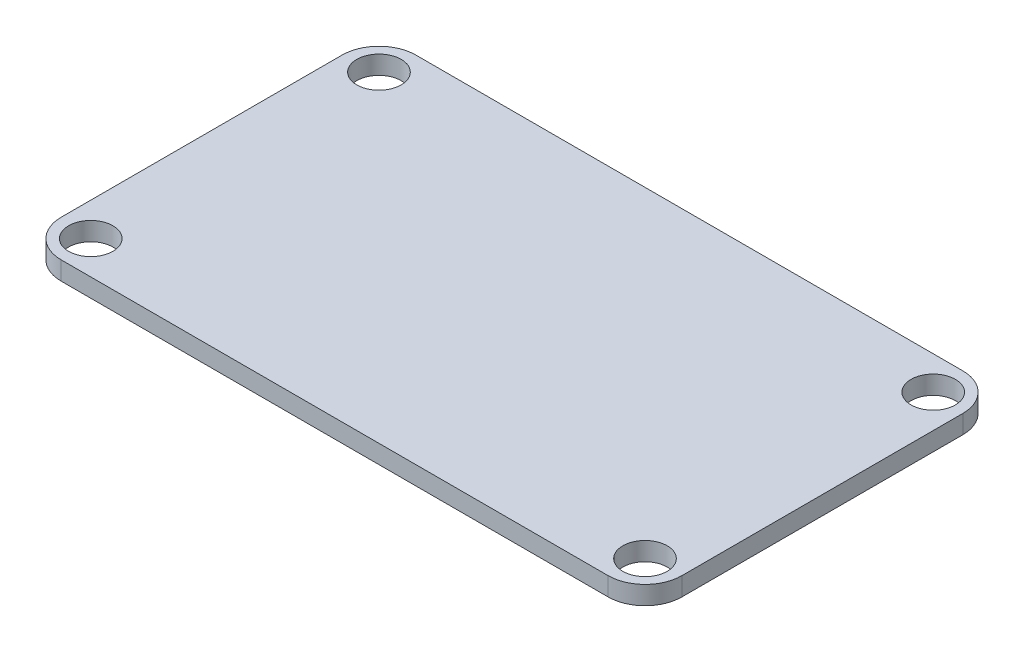
ISO-10303-21;
HEADER;
FILE_DESCRIPTION(('STEP AP214'),'2;1');
FILE_NAME('part.step','',(''),(''),'','','');
FILE_SCHEMA(('AUTOMOTIVE_DESIGN { 1 0 10303 214 1 1 1 1 }'));
ENDSEC;
DATA;
#1=APPLICATION_CONTEXT('core data for automotive mechanical design processes');
#2=APPLICATION_PROTOCOL_DEFINITION('international standard','automotive_design',2000,#1);
#3=PRODUCT_CONTEXT('',#1,'mechanical');
#4=PRODUCT('Part','Part','',(#3));
#5=PRODUCT_RELATED_PRODUCT_CATEGORY('part','',(#4));
#6=PRODUCT_DEFINITION_FORMATION('','',#4);
#7=PRODUCT_DEFINITION_CONTEXT('part definition',#1,'design');
#8=PRODUCT_DEFINITION('design','',#6,#7);
#9=PRODUCT_DEFINITION_SHAPE('','',#8);
#10=(LENGTH_UNIT() NAMED_UNIT(*) SI_UNIT(.MILLI.,.METRE.));
#11=(NAMED_UNIT(*) PLANE_ANGLE_UNIT() SI_UNIT($,.RADIAN.));
#12=(NAMED_UNIT(*) SI_UNIT($,.STERADIAN.) SOLID_ANGLE_UNIT());
#13=UNCERTAINTY_MEASURE_WITH_UNIT(LENGTH_MEASURE(1.E-05),#10,'distance_accuracy_value','');
#14=(GEOMETRIC_REPRESENTATION_CONTEXT(3) GLOBAL_UNCERTAINTY_ASSIGNED_CONTEXT((#13)) GLOBAL_UNIT_ASSIGNED_CONTEXT((#10,
#11,#12)) REPRESENTATION_CONTEXT('',''));
#15=CARTESIAN_POINT('',(0.,0.,0.));
#16=DIRECTION('',(0.,0.,1.));
#17=DIRECTION('',(1.,0.,0.));
#18=AXIS2_PLACEMENT_3D('',#15,#16,#17);
#19=CARTESIAN_POINT('',(50.165,1.5875,-27.305));
#20=DIRECTION('',(0.,-1.,0.));
#21=DIRECTION('',(0.,0.,-1.));
#22=AXIS2_PLACEMENT_3D('',#19,#20,#21);
#23=PLANE('',#22);
#24=CARTESIAN_POINT('',(50.165,1.5875,-27.305));
#25=DIRECTION('',(0.,1.,0.));
#26=DIRECTION('',(0.,0.,-1.));
#27=AXIS2_PLACEMENT_3D('',#24,#25,#26);
#28=CIRCLE('',#27,3.175);
#29=CARTESIAN_POINT('',(53.34,1.5875,-27.305));
#30=VERTEX_POINT('',#29);
#31=CARTESIAN_POINT('',(50.165,1.5875,-30.48));
#32=VERTEX_POINT('',#31);
#33=EDGE_CURVE('E146',#30,#32,#28,.T.);
#34=ORIENTED_EDGE('',*,*,#33,.T.);
#35=DIRECTION('',(-1.,0.,0.));
#36=VECTOR('',#35,1.);
#37=CARTESIAN_POINT('',(3.17500000000002,1.5875,-30.48));
#38=LINE('',#37,#36);
#39=CARTESIAN_POINT('',(3.17500000000002,1.5875,-30.48));
#40=VERTEX_POINT('',#39);
#41=EDGE_CURVE('E94',#32,#40,#38,.T.);
#42=ORIENTED_EDGE('',*,*,#41,.T.);
#43=CARTESIAN_POINT('',(3.175,1.5875,-27.305));
#44=DIRECTION('',(0.,1.,0.));
#45=DIRECTION('',(0.,0.,-1.));
#46=AXIS2_PLACEMENT_3D('',#43,#44,#45);
#47=CIRCLE('',#46,3.175);
#48=CARTESIAN_POINT('',(0.,1.5875,-27.305));
#49=VERTEX_POINT('',#48);
#50=EDGE_CURVE('E161',#40,#49,#47,.T.);
#51=ORIENTED_EDGE('',*,*,#50,.T.);
#52=DIRECTION('',(0.,0.,1.));
#53=VECTOR('',#52,1.);
#54=CARTESIAN_POINT('',(0.,1.5875,-3.17500000000002));
#55=LINE('',#54,#53);
#56=CARTESIAN_POINT('',(0.,1.5875,-3.17500000000002));
#57=VERTEX_POINT('',#56);
#58=EDGE_CURVE('E174',#49,#57,#55,.T.);
#59=ORIENTED_EDGE('',*,*,#58,.T.);
#60=CARTESIAN_POINT('',(3.175,1.5875,-3.175));
#61=DIRECTION('',(0.,1.,0.));
#62=DIRECTION('',(0.,0.,-1.));
#63=AXIS2_PLACEMENT_3D('',#60,#61,#62);
#64=CIRCLE('',#63,3.175);
#65=CARTESIAN_POINT('',(3.17500000000002,1.5875,0.));
#66=VERTEX_POINT('',#65);
#67=EDGE_CURVE('E113',#57,#66,#64,.T.);
#68=ORIENTED_EDGE('',*,*,#67,.T.);
#69=DIRECTION('',(1.,0.,0.));
#70=VECTOR('',#69,1.);
#71=CARTESIAN_POINT('',(3.17500000000002,1.5875,0.));
#72=LINE('',#71,#70);
#73=CARTESIAN_POINT('',(50.165,1.5875,0.));
#74=VERTEX_POINT('',#73);
#75=EDGE_CURVE('E107',#66,#74,#72,.T.);
#76=ORIENTED_EDGE('',*,*,#75,.T.);
#77=CARTESIAN_POINT('',(50.165,1.5875,-3.175));
#78=DIRECTION('',(0.,1.,0.));
#79=DIRECTION('',(0.,0.,1.));
#80=AXIS2_PLACEMENT_3D('',#77,#78,#79);
#81=CIRCLE('',#80,3.175);
#82=CARTESIAN_POINT('',(53.34,1.5875,-3.17500000000002));
#83=VERTEX_POINT('',#82);
#84=EDGE_CURVE('E111',#74,#83,#81,.T.);
#85=ORIENTED_EDGE('',*,*,#84,.T.);
#86=DIRECTION('',(0.,0.,-1.));
#87=VECTOR('',#86,1.);
#88=CARTESIAN_POINT('',(53.34,1.5875,-3.17500000000002));
#89=LINE('',#88,#87);
#90=EDGE_CURVE('E51',#83,#30,#89,.T.);
#91=ORIENTED_EDGE('',*,*,#90,.T.);
#92=EDGE_LOOP('',(#34,#42,#51,#59,#68,#76,#85,#91));
#93=FACE_BOUND('',#92,.T.);
#94=CARTESIAN_POINT('',(2.8575,1.5875,-2.8575));
#95=DIRECTION('',(0.,1.,0.));
#96=DIRECTION('',(0.,0.,1.));
#97=AXIS2_PLACEMENT_3D('',#94,#95,#96);
#98=CIRCLE('',#97,1.905);
#99=CARTESIAN_POINT('',(2.8575,1.5875,-0.952499999999999));
#100=VERTEX_POINT('',#99);
#101=EDGE_CURVE('E135',#100,#100,#98,.T.);
#102=ORIENTED_EDGE('',*,*,#101,.F.);
#103=EDGE_LOOP('',(#102));
#104=FACE_BOUND('',#103,.T.);
#105=CARTESIAN_POINT('',(2.8575,1.5875,-27.6225));
#106=DIRECTION('',(0.,1.,0.));
#107=DIRECTION('',(0.,0.,1.));
#108=AXIS2_PLACEMENT_3D('',#105,#106,#107);
#109=CIRCLE('',#108,1.905);
#110=CARTESIAN_POINT('',(2.8575,1.5875,-25.7175));
#111=VERTEX_POINT('',#110);
#112=EDGE_CURVE('E183',#111,#111,#109,.T.);
#113=ORIENTED_EDGE('',*,*,#112,.F.);
#114=EDGE_LOOP('',(#113));
#115=FACE_BOUND('',#114,.T.);
#116=CARTESIAN_POINT('',(50.4825,1.5875,-27.6225));
#117=DIRECTION('',(0.,1.,0.));
#118=DIRECTION('',(0.,0.,1.));
#119=AXIS2_PLACEMENT_3D('',#116,#117,#118);
#120=CIRCLE('',#119,1.905);
#121=CARTESIAN_POINT('',(50.4825,1.5875,-25.7175));
#122=VERTEX_POINT('',#121);
#123=EDGE_CURVE('E189',#122,#122,#120,.T.);
#124=ORIENTED_EDGE('',*,*,#123,.F.);
#125=EDGE_LOOP('',(#124));
#126=FACE_BOUND('',#125,.T.);
#127=CARTESIAN_POINT('',(50.4825,1.5875,-2.8575));
#128=DIRECTION('',(0.,1.,0.));
#129=DIRECTION('',(0.,0.,1.));
#130=AXIS2_PLACEMENT_3D('',#127,#128,#129);
#131=CIRCLE('',#130,1.905);
#132=CARTESIAN_POINT('',(50.4825,1.5875,-0.952499999999999));
#133=VERTEX_POINT('',#132);
#134=EDGE_CURVE('E195',#133,#133,#131,.T.);
#135=ORIENTED_EDGE('',*,*,#134,.F.);
#136=EDGE_LOOP('',(#135));
#137=FACE_BOUND('',#136,.T.);
#138=ADVANCED_FACE('F34',(#93,#104,#115,#126,#137),#23,.F.);
#139=CARTESIAN_POINT('',(50.165,0.,-27.305));
#140=DIRECTION('',(0.,-1.,0.));
#141=DIRECTION('',(0.,0.,-1.));
#142=AXIS2_PLACEMENT_3D('',#139,#140,#141);
#143=PLANE('',#142);
#144=CARTESIAN_POINT('',(50.4825,0.,-27.6225));
#145=DIRECTION('',(0.,1.,0.));
#146=DIRECTION('',(0.,0.,1.));
#147=AXIS2_PLACEMENT_3D('',#144,#145,#146);
#148=CIRCLE('',#147,1.905);
#149=CARTESIAN_POINT('',(50.4825,0.,-25.7175));
#150=VERTEX_POINT('',#149);
#151=EDGE_CURVE('E192',#150,#150,#148,.T.);
#152=ORIENTED_EDGE('',*,*,#151,.T.);
#153=EDGE_LOOP('',(#152));
#154=FACE_BOUND('',#153,.T.);
#155=CARTESIAN_POINT('',(2.8575,0.,-2.8575));
#156=DIRECTION('',(0.,1.,0.));
#157=DIRECTION('',(0.,0.,1.));
#158=AXIS2_PLACEMENT_3D('',#155,#156,#157);
#159=CIRCLE('',#158,1.905);
#160=CARTESIAN_POINT('',(2.8575,0.,-0.952499999999999));
#161=VERTEX_POINT('',#160);
#162=EDGE_CURVE('E180',#161,#161,#159,.T.);
#163=ORIENTED_EDGE('',*,*,#162,.T.);
#164=EDGE_LOOP('',(#163));
#165=FACE_BOUND('',#164,.T.);
#166=CARTESIAN_POINT('',(50.165,0.,-27.305));
#167=DIRECTION('',(0.,1.,0.));
#168=DIRECTION('',(0.,0.,-1.));
#169=AXIS2_PLACEMENT_3D('',#166,#167,#168);
#170=CIRCLE('',#169,3.175);
#171=CARTESIAN_POINT('',(53.34,0.,-27.305));
#172=VERTEX_POINT('',#171);
#173=CARTESIAN_POINT('',(50.165,0.,-30.48));
#174=VERTEX_POINT('',#173);
#175=EDGE_CURVE('E131',#172,#174,#170,.T.);
#176=ORIENTED_EDGE('',*,*,#175,.F.);
#177=DIRECTION('',(0.,0.,-1.));
#178=VECTOR('',#177,1.);
#179=CARTESIAN_POINT('',(53.34,0.,-3.17500000000002));
#180=LINE('',#179,#178);
#181=CARTESIAN_POINT('',(53.34,0.,-3.17500000000002));
#182=VERTEX_POINT('',#181);
#183=EDGE_CURVE('E86',#182,#172,#180,.T.);
#184=ORIENTED_EDGE('',*,*,#183,.F.);
#185=CARTESIAN_POINT('',(50.165,0.,-3.175));
#186=DIRECTION('',(0.,1.,0.));
#187=DIRECTION('',(0.,0.,1.));
#188=AXIS2_PLACEMENT_3D('',#185,#186,#187);
#189=CIRCLE('',#188,3.175);
#190=CARTESIAN_POINT('',(50.165,0.,0.));
#191=VERTEX_POINT('',#190);
#192=EDGE_CURVE('E80',#191,#182,#189,.T.);
#193=ORIENTED_EDGE('',*,*,#192,.F.);
#194=DIRECTION('',(1.,0.,0.));
#195=VECTOR('',#194,1.);
#196=CARTESIAN_POINT('',(3.17500000000002,0.,0.));
#197=LINE('',#196,#195);
#198=CARTESIAN_POINT('',(3.17500000000002,0.,0.));
#199=VERTEX_POINT('',#198);
#200=EDGE_CURVE('E121',#199,#191,#197,.T.);
#201=ORIENTED_EDGE('',*,*,#200,.F.);
#202=CARTESIAN_POINT('',(3.175,0.,-3.175));
#203=DIRECTION('',(0.,1.,0.));
#204=DIRECTION('',(0.,0.,-1.));
#205=AXIS2_PLACEMENT_3D('',#202,#203,#204);
#206=CIRCLE('',#205,3.175);
#207=CARTESIAN_POINT('',(0.,0.,-3.17500000000002));
#208=VERTEX_POINT('',#207);
#209=EDGE_CURVE('E141',#208,#199,#206,.T.);
#210=ORIENTED_EDGE('',*,*,#209,.F.);
#211=DIRECTION('',(0.,0.,1.));
#212=VECTOR('',#211,1.);
#213=CARTESIAN_POINT('',(0.,0.,-3.17500000000002));
#214=LINE('',#213,#212);
#215=CARTESIAN_POINT('',(0.,0.,-27.305));
#216=VERTEX_POINT('',#215);
#217=EDGE_CURVE('E139',#216,#208,#214,.T.);
#218=ORIENTED_EDGE('',*,*,#217,.F.);
#219=CARTESIAN_POINT('',(3.175,0.,-27.305));
#220=DIRECTION('',(0.,1.,0.));
#221=DIRECTION('',(0.,0.,-1.));
#222=AXIS2_PLACEMENT_3D('',#219,#220,#221);
#223=CIRCLE('',#222,3.175);
#224=CARTESIAN_POINT('',(3.17500000000002,0.,-30.48));
#225=VERTEX_POINT('',#224);
#226=EDGE_CURVE('E137',#225,#216,#223,.T.);
#227=ORIENTED_EDGE('',*,*,#226,.F.);
#228=DIRECTION('',(-1.,0.,0.));
#229=VECTOR('',#228,1.);
#230=CARTESIAN_POINT('',(3.17500000000002,0.,-30.48));
#231=LINE('',#230,#229);
#232=EDGE_CURVE('E134',#174,#225,#231,.T.);
#233=ORIENTED_EDGE('',*,*,#232,.F.);
#234=EDGE_LOOP('',(#176,#184,#193,#201,#210,#218,#227,#233));
#235=FACE_BOUND('',#234,.T.);
#236=CARTESIAN_POINT('',(2.8575,0.,-27.6225));
#237=DIRECTION('',(0.,1.,0.));
#238=DIRECTION('',(0.,0.,1.));
#239=AXIS2_PLACEMENT_3D('',#236,#237,#238);
#240=CIRCLE('',#239,1.905);
#241=CARTESIAN_POINT('',(2.8575,0.,-25.7175));
#242=VERTEX_POINT('',#241);
#243=EDGE_CURVE('E186',#242,#242,#240,.T.);
#244=ORIENTED_EDGE('',*,*,#243,.T.);
#245=EDGE_LOOP('',(#244));
#246=FACE_BOUND('',#245,.T.);
#247=CARTESIAN_POINT('',(50.4825,0.,-2.8575));
#248=DIRECTION('',(0.,1.,0.));
#249=DIRECTION('',(0.,0.,1.));
#250=AXIS2_PLACEMENT_3D('',#247,#248,#249);
#251=CIRCLE('',#250,1.905);
#252=CARTESIAN_POINT('',(50.4825,0.,-0.952499999999999));
#253=VERTEX_POINT('',#252);
#254=EDGE_CURVE('E198',#253,#253,#251,.T.);
#255=ORIENTED_EDGE('',*,*,#254,.T.);
#256=EDGE_LOOP('',(#255));
#257=FACE_BOUND('',#256,.T.);
#258=ADVANCED_FACE('F165',(#154,#165,#235,#246,#257),#143,.T.);
#259=CARTESIAN_POINT('',(50.165,1.5875,-27.305));
#260=DIRECTION('',(0.,-1.,0.));
#261=DIRECTION('',(0.,0.,-1.));
#262=AXIS2_PLACEMENT_3D('',#259,#260,#261);
#263=CYLINDRICAL_SURFACE('',#262,3.175);
#264=ORIENTED_EDGE('',*,*,#175,.T.);
#265=DIRECTION('',(0.,-1.,0.));
#266=VECTOR('',#265,1.);
#267=CARTESIAN_POINT('',(50.165,1.5875,-30.48));
#268=LINE('',#267,#266);
#269=EDGE_CURVE('E11',#32,#174,#268,.T.);
#270=ORIENTED_EDGE('',*,*,#269,.F.);
#271=ORIENTED_EDGE('',*,*,#33,.F.);
#272=DIRECTION('',(0.,-1.,0.));
#273=VECTOR('',#272,1.);
#274=CARTESIAN_POINT('',(53.34,1.5875,-27.305));
#275=LINE('',#274,#273);
#276=EDGE_CURVE('E127',#30,#172,#275,.T.);
#277=ORIENTED_EDGE('',*,*,#276,.T.);
#278=EDGE_LOOP('',(#264,#270,#271,#277));
#279=FACE_BOUND('',#278,.T.);
#280=ADVANCED_FACE('F36',(#279),#263,.T.);
#281=CARTESIAN_POINT('',(3.17500000000002,1.5875,-30.48));
#282=DIRECTION('',(0.,0.,1.));
#283=DIRECTION('',(1.,0.,0.));
#284=AXIS2_PLACEMENT_3D('',#281,#282,#283);
#285=PLANE('',#284);
#286=ORIENTED_EDGE('',*,*,#232,.T.);
#287=DIRECTION('',(0.,-1.,0.));
#288=VECTOR('',#287,1.);
#289=CARTESIAN_POINT('',(3.17500000000002,1.5875,-30.48));
#290=LINE('',#289,#288);
#291=EDGE_CURVE('E43',#40,#225,#290,.T.);
#292=ORIENTED_EDGE('',*,*,#291,.F.);
#293=ORIENTED_EDGE('',*,*,#41,.F.);
#294=ORIENTED_EDGE('',*,*,#269,.T.);
#295=EDGE_LOOP('',(#286,#292,#293,#294));
#296=FACE_BOUND('',#295,.T.);
#297=ADVANCED_FACE('F230',(#296),#285,.F.);
#298=CARTESIAN_POINT('',(3.175,1.5875,-27.305));
#299=DIRECTION('',(0.,-1.,0.));
#300=DIRECTION('',(0.,0.,-1.));
#301=AXIS2_PLACEMENT_3D('',#298,#299,#300);
#302=CYLINDRICAL_SURFACE('',#301,3.175);
#303=ORIENTED_EDGE('',*,*,#226,.T.);
#304=DIRECTION('',(0.,-1.,0.));
#305=VECTOR('',#304,1.);
#306=CARTESIAN_POINT('',(0.,1.5875,-27.305));
#307=LINE('',#306,#305);
#308=EDGE_CURVE('E153',#49,#216,#307,.T.);
#309=ORIENTED_EDGE('',*,*,#308,.F.);
#310=ORIENTED_EDGE('',*,*,#50,.F.);
#311=ORIENTED_EDGE('',*,*,#291,.T.);
#312=EDGE_LOOP('',(#303,#309,#310,#311));
#313=FACE_BOUND('',#312,.T.);
#314=ADVANCED_FACE('F159',(#313),#302,.T.);
#315=CARTESIAN_POINT('',(0.,1.5875,-3.17500000000002));
#316=DIRECTION('',(1.,0.,0.));
#317=DIRECTION('',(0.,0.,-1.));
#318=AXIS2_PLACEMENT_3D('',#315,#316,#317);
#319=PLANE('',#318);
#320=ORIENTED_EDGE('',*,*,#217,.T.);
#321=DIRECTION('',(0.,-1.,0.));
#322=VECTOR('',#321,1.);
#323=CARTESIAN_POINT('',(0.,1.5875,-3.17500000000002));
#324=LINE('',#323,#322);
#325=EDGE_CURVE('E150',#57,#208,#324,.T.);
#326=ORIENTED_EDGE('',*,*,#325,.F.);
#327=ORIENTED_EDGE('',*,*,#58,.F.);
#328=ORIENTED_EDGE('',*,*,#308,.T.);
#329=EDGE_LOOP('',(#320,#326,#327,#328));
#330=FACE_BOUND('',#329,.T.);
#331=ADVANCED_FACE('F170',(#330),#319,.F.);
#332=CARTESIAN_POINT('',(3.175,1.5875,-3.175));
#333=DIRECTION('',(0.,-1.,0.));
#334=DIRECTION('',(0.,0.,-1.));
#335=AXIS2_PLACEMENT_3D('',#332,#333,#334);
#336=CYLINDRICAL_SURFACE('',#335,3.175);
#337=ORIENTED_EDGE('',*,*,#209,.T.);
#338=DIRECTION('',(0.,-1.,0.));
#339=VECTOR('',#338,1.);
#340=CARTESIAN_POINT('',(3.17500000000002,1.5875,0.));
#341=LINE('',#340,#339);
#342=EDGE_CURVE('E122',#66,#199,#341,.T.);
#343=ORIENTED_EDGE('',*,*,#342,.F.);
#344=ORIENTED_EDGE('',*,*,#67,.F.);
#345=ORIENTED_EDGE('',*,*,#325,.T.);
#346=EDGE_LOOP('',(#337,#343,#344,#345));
#347=FACE_BOUND('',#346,.T.);
#348=ADVANCED_FACE('F173',(#347),#336,.T.);
#349=CARTESIAN_POINT('',(3.17500000000002,1.5875,0.));
#350=DIRECTION('',(0.,0.,-1.));
#351=DIRECTION('',(-1.,0.,0.));
#352=AXIS2_PLACEMENT_3D('',#349,#350,#351);
#353=PLANE('',#352);
#354=ORIENTED_EDGE('',*,*,#200,.T.);
#355=DIRECTION('',(0.,-1.,0.));
#356=VECTOR('',#355,1.);
#357=CARTESIAN_POINT('',(50.165,1.5875,0.));
#358=LINE('',#357,#356);
#359=EDGE_CURVE('E118',#74,#191,#358,.T.);
#360=ORIENTED_EDGE('',*,*,#359,.F.);
#361=ORIENTED_EDGE('',*,*,#75,.F.);
#362=ORIENTED_EDGE('',*,*,#342,.T.);
#363=EDGE_LOOP('',(#354,#360,#361,#362));
#364=FACE_BOUND('',#363,.T.);
#365=ADVANCED_FACE('F119',(#364),#353,.F.);
#366=CARTESIAN_POINT('',(50.165,1.5875,-3.175));
#367=DIRECTION('',(0.,-1.,0.));
#368=DIRECTION('',(0.,0.,-1.));
#369=AXIS2_PLACEMENT_3D('',#366,#367,#368);
#370=CYLINDRICAL_SURFACE('',#369,3.175);
#371=ORIENTED_EDGE('',*,*,#192,.T.);
#372=DIRECTION('',(0.,-1.,0.));
#373=VECTOR('',#372,1.);
#374=CARTESIAN_POINT('',(53.34,1.5875,-3.17500000000002));
#375=LINE('',#374,#373);
#376=EDGE_CURVE('E123',#83,#182,#375,.T.);
#377=ORIENTED_EDGE('',*,*,#376,.F.);
#378=ORIENTED_EDGE('',*,*,#84,.F.);
#379=ORIENTED_EDGE('',*,*,#359,.T.);
#380=EDGE_LOOP('',(#371,#377,#378,#379));
#381=FACE_BOUND('',#380,.T.);
#382=ADVANCED_FACE('F125',(#381),#370,.T.);
#383=CARTESIAN_POINT('',(53.34,1.5875,-3.17500000000002));
#384=DIRECTION('',(-1.,0.,0.));
#385=DIRECTION('',(0.,0.,1.));
#386=AXIS2_PLACEMENT_3D('',#383,#384,#385);
#387=PLANE('',#386);
#388=ORIENTED_EDGE('',*,*,#183,.T.);
#389=ORIENTED_EDGE('',*,*,#276,.F.);
#390=ORIENTED_EDGE('',*,*,#90,.F.);
#391=ORIENTED_EDGE('',*,*,#376,.T.);
#392=EDGE_LOOP('',(#388,#389,#390,#391));
#393=FACE_BOUND('',#392,.T.);
#394=ADVANCED_FACE('F218',(#393),#387,.F.);
#395=CARTESIAN_POINT('',(2.8575,1.5875,-2.8575));
#396=DIRECTION('',(0.,-1.,0.));
#397=DIRECTION('',(0.,0.,-1.));
#398=AXIS2_PLACEMENT_3D('',#395,#396,#397);
#399=CYLINDRICAL_SURFACE('',#398,1.905);
#400=ORIENTED_EDGE('',*,*,#101,.T.);
#401=EDGE_LOOP('',(#400));
#402=FACE_BOUND('',#401,.T.);
#403=ORIENTED_EDGE('',*,*,#162,.F.);
#404=EDGE_LOOP('',(#403));
#405=FACE_BOUND('',#404,.T.);
#406=ADVANCED_FACE('F215',(#402,#405),#399,.F.);
#407=CARTESIAN_POINT('',(2.8575,1.5875,-27.6225));
#408=DIRECTION('',(0.,-1.,0.));
#409=DIRECTION('',(0.,0.,-1.));
#410=AXIS2_PLACEMENT_3D('',#407,#408,#409);
#411=CYLINDRICAL_SURFACE('',#410,1.905);
#412=ORIENTED_EDGE('',*,*,#112,.T.);
#413=EDGE_LOOP('',(#412));
#414=FACE_BOUND('',#413,.T.);
#415=ORIENTED_EDGE('',*,*,#243,.F.);
#416=EDGE_LOOP('',(#415));
#417=FACE_BOUND('',#416,.T.);
#418=ADVANCED_FACE('F294',(#414,#417),#411,.F.);
#419=CARTESIAN_POINT('',(50.4825,1.5875,-27.6225));
#420=DIRECTION('',(0.,-1.,0.));
#421=DIRECTION('',(0.,0.,-1.));
#422=AXIS2_PLACEMENT_3D('',#419,#420,#421);
#423=CYLINDRICAL_SURFACE('',#422,1.905);
#424=ORIENTED_EDGE('',*,*,#123,.T.);
#425=EDGE_LOOP('',(#424));
#426=FACE_BOUND('',#425,.T.);
#427=ORIENTED_EDGE('',*,*,#151,.F.);
#428=EDGE_LOOP('',(#427));
#429=FACE_BOUND('',#428,.T.);
#430=ADVANCED_FACE('F302',(#426,#429),#423,.F.);
#431=CARTESIAN_POINT('',(50.4825,1.5875,-2.8575));
#432=DIRECTION('',(0.,-1.,0.));
#433=DIRECTION('',(0.,0.,-1.));
#434=AXIS2_PLACEMENT_3D('',#431,#432,#433);
#435=CYLINDRICAL_SURFACE('',#434,1.905);
#436=ORIENTED_EDGE('',*,*,#134,.T.);
#437=EDGE_LOOP('',(#436));
#438=FACE_BOUND('',#437,.T.);
#439=ORIENTED_EDGE('',*,*,#254,.F.);
#440=EDGE_LOOP('',(#439));
#441=FACE_BOUND('',#440,.T.);
#442=ADVANCED_FACE('F204',(#438,#441),#435,.F.);
#443=CLOSED_SHELL('',(#138,#258,#280,#297,#314,#331,#348,#365,#382,#394,#406,#418,#430,#442));
#444=MANIFOLD_SOLID_BREP('B2',#443);
#445=ADVANCED_BREP_SHAPE_REPRESENTATION('',(#18,#444),#14);
#446=SHAPE_DEFINITION_REPRESENTATION(#9,#445);
ENDSEC;
END-ISO-10303-21;
